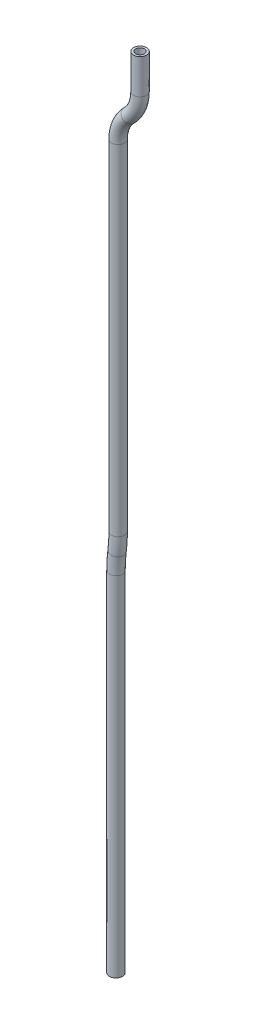
ISO-10303-21;
HEADER;
FILE_DESCRIPTION(('STEP AP214'),'2;1');
FILE_NAME('part.step','',(''),(''),'','','');
FILE_SCHEMA(('AUTOMOTIVE_DESIGN { 1 0 10303 214 1 1 1 1 }'));
ENDSEC;
DATA;
#1=APPLICATION_CONTEXT('core data for automotive mechanical design processes');
#2=APPLICATION_PROTOCOL_DEFINITION('international standard','automotive_design',2000,#1);
#3=PRODUCT_CONTEXT('',#1,'mechanical');
#4=PRODUCT('Part','Part','',(#3));
#5=PRODUCT_RELATED_PRODUCT_CATEGORY('part','',(#4));
#6=PRODUCT_DEFINITION_FORMATION('','',#4);
#7=PRODUCT_DEFINITION_CONTEXT('part definition',#1,'design');
#8=PRODUCT_DEFINITION('design','',#6,#7);
#9=PRODUCT_DEFINITION_SHAPE('','',#8);
#10=(LENGTH_UNIT() NAMED_UNIT(*) SI_UNIT(.MILLI.,.METRE.));
#11=(NAMED_UNIT(*) PLANE_ANGLE_UNIT() SI_UNIT($,.RADIAN.));
#12=(NAMED_UNIT(*) SI_UNIT($,.STERADIAN.) SOLID_ANGLE_UNIT());
#13=UNCERTAINTY_MEASURE_WITH_UNIT(LENGTH_MEASURE(1.E-05),#10,'distance_accuracy_value','');
#14=(GEOMETRIC_REPRESENTATION_CONTEXT(3) GLOBAL_UNCERTAINTY_ASSIGNED_CONTEXT((#13)) GLOBAL_UNIT_ASSIGNED_CONTEXT((#10,
#11,#12)) REPRESENTATION_CONTEXT('',''));
#15=CARTESIAN_POINT('',(0.,0.,0.));
#16=DIRECTION('',(0.,0.,1.));
#17=DIRECTION('',(1.,0.,0.));
#18=AXIS2_PLACEMENT_3D('',#15,#16,#17);
#19=CARTESIAN_POINT('',(17.552982674,590.55,0.));
#20=DIRECTION('',(0.,-1.,0.));
#21=DIRECTION('',(0.,0.,-1.));
#22=AXIS2_PLACEMENT_3D('',#19,#20,#21);
#23=CYLINDRICAL_SURFACE('',#22,4.7625);
#24=CARTESIAN_POINT('',(17.552982674,565.15,0.));
#25=DIRECTION('',(0.,1.,0.));
#26=DIRECTION('',(0.,0.,1.));
#27=AXIS2_PLACEMENT_3D('',#24,#25,#26);
#28=CIRCLE('',#27,4.7625);
#29=CARTESIAN_POINT('',(22.315482674,565.15,0.));
#30=VERTEX_POINT('',#29);
#31=EDGE_CURVE('E61',#30,#30,#28,.T.);
#32=ORIENTED_EDGE('',*,*,#31,.T.);
#33=EDGE_LOOP('',(#32));
#34=FACE_BOUND('',#33,.T.);
#35=CARTESIAN_POINT('',(17.552982674,590.55,0.));
#36=DIRECTION('',(0.,1.,0.));
#37=DIRECTION('',(0.,0.,1.));
#38=AXIS2_PLACEMENT_3D('',#35,#36,#37);
#39=CIRCLE('',#38,4.7625);
#40=CARTESIAN_POINT('',(17.552982674,590.55,4.7625));
#41=VERTEX_POINT('',#40);
#42=EDGE_CURVE('E58',#41,#41,#39,.T.);
#43=ORIENTED_EDGE('',*,*,#42,.F.);
#44=EDGE_LOOP('',(#43));
#45=FACE_BOUND('',#44,.T.);
#46=ADVANCED_FACE('F37',(#34,#45),#23,.T.);
#47=CARTESIAN_POINT('',(-9.16883137727299,565.15,0.));
#48=DIRECTION('',(0.,0.,-1.));
#49=DIRECTION('',(-1.,0.,0.));
#50=AXIS2_PLACEMENT_3D('',#47,#48,#49);
#51=TOROIDAL_SURFACE('',#50,26.721814051273,4.7625);
#52=CARTESIAN_POINT('',(9.57024133699998,546.1,0.));
#53=DIRECTION('',(0.712900702154707,0.70126499190201,0.));
#54=DIRECTION('',(0.,0.,1.));
#55=AXIS2_PLACEMENT_3D('',#52,#53,#54);
#56=CIRCLE('',#55,4.7625);
#57=CARTESIAN_POINT('',(12.9100158609333,542.704810405988,0.));
#58=VERTEX_POINT('',#57);
#59=EDGE_CURVE('E64',#58,#58,#56,.T.);
#60=CARTESIAN_POINT('',(-9.16883137727299,565.15,0.));
#61=DIRECTION('',(0.,0.,-1.));
#62=DIRECTION('',(-1.,0.,0.));
#63=AXIS2_PLACEMENT_3D('',#60,#61,#62);
#64=CIRCLE('',#63,31.484314051273);
#65=EDGE_CURVE('',#30,#58,#64,.T.);
#66=ORIENTED_EDGE('',*,*,#31,.F.);
#67=ORIENTED_EDGE('',*,*,#59,.T.);
#68=ORIENTED_EDGE('',*,*,#65,.T.);
#69=ORIENTED_EDGE('',*,*,#65,.F.);
#70=EDGE_LOOP('',(#66,#68,#67,#69));
#71=FACE_BOUND('',#70,.T.);
#72=ADVANCED_FACE('F112',(#71),#51,.T.);
#73=CARTESIAN_POINT('',(28.309314051273,527.05,0.));
#74=DIRECTION('',(0.,0.,1.));
#75=DIRECTION('',(1.,0.,0.));
#76=AXIS2_PLACEMENT_3D('',#73,#74,#75);
#77=TOROIDAL_SURFACE('',#76,26.7218140512729,4.7625);
#78=CARTESIAN_POINT('',(1.58750000000004,527.05,0.));
#79=DIRECTION('',(0.,1.,0.));
#80=DIRECTION('',(0.,0.,1.));
#81=AXIS2_PLACEMENT_3D('',#78,#79,#80);
#82=CIRCLE('',#81,4.7625);
#83=CARTESIAN_POINT('',(1.58750000000004,527.05,4.7625));
#84=VERTEX_POINT('',#83);
#85=EDGE_CURVE('E67',#84,#84,#82,.T.);
#86=ORIENTED_EDGE('',*,*,#85,.T.);
#87=EDGE_LOOP('',(#86));
#88=FACE_BOUND('',#87,.T.);
#89=ORIENTED_EDGE('',*,*,#59,.F.);
#90=EDGE_LOOP('',(#89));
#91=FACE_BOUND('',#90,.T.);
#92=ADVANCED_FACE('F116',(#88,#91),#77,.T.);
#93=CARTESIAN_POINT('',(1.5875,527.05,0.));
#94=DIRECTION('',(0.,-1.,0.));
#95=DIRECTION('',(1.,0.,0.));
#96=AXIS2_PLACEMENT_3D('',#93,#94,#95);
#97=CYLINDRICAL_SURFACE('',#96,4.7625);
#98=CARTESIAN_POINT('',(1.58750000000001,279.4,0.));
#99=DIRECTION('',(0.,1.,0.));
#100=DIRECTION('',(0.,0.,1.));
#101=AXIS2_PLACEMENT_3D('',#98,#99,#100);
#102=CIRCLE('',#101,4.7625);
#103=CARTESIAN_POINT('',(6.35000000000001,279.4,0.));
#104=VERTEX_POINT('',#103);
#105=EDGE_CURVE('E70',#104,#104,#102,.T.);
#106=ORIENTED_EDGE('',*,*,#105,.T.);
#107=EDGE_LOOP('',(#106));
#108=FACE_BOUND('',#107,.T.);
#109=ORIENTED_EDGE('',*,*,#85,.F.);
#110=EDGE_LOOP('',(#109));
#111=FACE_BOUND('',#110,.T.);
#112=ADVANCED_FACE('F120',(#108,#111),#97,.T.);
#113=CARTESIAN_POINT('',(-100.409375000001,279.4,0.));
#114=DIRECTION('',(0.,0.,-1.));
#115=DIRECTION('',(-1.,0.,0.));
#116=AXIS2_PLACEMENT_3D('',#113,#114,#115);
#117=TOROIDAL_SURFACE('',#116,101.996875000001,4.7625);
#118=CARTESIAN_POINT('',(0.79375000000001,266.7,0.));
#119=DIRECTION('',(0.124513618677041,0.992217898832685,0.));
#120=DIRECTION('',(0.,0.,1.));
#121=AXIS2_PLACEMENT_3D('',#118,#119,#120);
#122=CIRCLE('',#121,4.7625);
#123=CARTESIAN_POINT('',(5.51918774319068,266.107003891051,0.));
#124=VERTEX_POINT('',#123);
#125=EDGE_CURVE('E72',#124,#124,#122,.T.);
#126=CARTESIAN_POINT('',(-100.409375000001,279.4,0.));
#127=DIRECTION('',(0.,0.,-1.));
#128=DIRECTION('',(-1.,0.,0.));
#129=AXIS2_PLACEMENT_3D('',#126,#127,#128);
#130=CIRCLE('',#129,106.759375000001);
#131=EDGE_CURVE('',#104,#124,#130,.T.);
#132=ORIENTED_EDGE('',*,*,#105,.F.);
#133=ORIENTED_EDGE('',*,*,#125,.T.);
#134=ORIENTED_EDGE('',*,*,#131,.T.);
#135=ORIENTED_EDGE('',*,*,#131,.F.);
#136=EDGE_LOOP('',(#132,#134,#133,#135));
#137=FACE_BOUND('',#136,.T.);
#138=ADVANCED_FACE('F92',(#137),#117,.T.);
#139=CARTESIAN_POINT('',(101.996875000001,254.,0.));
#140=DIRECTION('',(0.,0.,1.));
#141=DIRECTION('',(1.,0.,0.));
#142=AXIS2_PLACEMENT_3D('',#139,#140,#141);
#143=TOROIDAL_SURFACE('',#142,101.996875000001,4.7625);
#144=CARTESIAN_POINT('',(0.,254.,0.));
#145=DIRECTION('',(0.,1.,0.));
#146=DIRECTION('',(0.,0.,1.));
#147=AXIS2_PLACEMENT_3D('',#144,#145,#146);
#148=CIRCLE('',#147,4.7625);
#149=CARTESIAN_POINT('',(0.,254.,4.7625));
#150=VERTEX_POINT('',#149);
#151=EDGE_CURVE('E41',#150,#150,#148,.T.);
#152=ORIENTED_EDGE('',*,*,#151,.T.);
#153=EDGE_LOOP('',(#152));
#154=FACE_BOUND('',#153,.T.);
#155=ORIENTED_EDGE('',*,*,#125,.F.);
#156=EDGE_LOOP('',(#155));
#157=FACE_BOUND('',#156,.T.);
#158=ADVANCED_FACE('F79',(#154,#157),#143,.T.);
#159=CARTESIAN_POINT('',(0.,254.,0.));
#160=DIRECTION('',(0.,-1.,0.));
#161=DIRECTION('',(0.,0.,-1.));
#162=AXIS2_PLACEMENT_3D('',#159,#160,#161);
#163=CYLINDRICAL_SURFACE('',#162,4.7625);
#164=CARTESIAN_POINT('',(0.,0.,0.));
#165=DIRECTION('',(0.,1.,0.));
#166=DIRECTION('',(0.,0.,1.));
#167=AXIS2_PLACEMENT_3D('',#164,#165,#166);
#168=CIRCLE('',#167,4.7625);
#169=CARTESIAN_POINT('',(0.,0.,4.7625));
#170=VERTEX_POINT('',#169);
#171=EDGE_CURVE('E54',#170,#170,#168,.T.);
#172=ORIENTED_EDGE('',*,*,#171,.T.);
#173=EDGE_LOOP('',(#172));
#174=FACE_BOUND('',#173,.T.);
#175=ORIENTED_EDGE('',*,*,#151,.F.);
#176=EDGE_LOOP('',(#175));
#177=FACE_BOUND('',#176,.T.);
#178=ADVANCED_FACE('F39',(#174,#177),#163,.T.);
#179=CARTESIAN_POINT('',(17.552982674,590.55,0.));
#180=DIRECTION('',(0.,1.,0.));
#181=DIRECTION('',(0.,0.,1.));
#182=AXIS2_PLACEMENT_3D('',#179,#180,#181);
#183=PLANE('',#182);
#184=CARTESIAN_POINT('',(17.552982674,590.55,0.));
#185=DIRECTION('',(0.,1.,0.));
#186=DIRECTION('',(0.,0.,1.));
#187=AXIS2_PLACEMENT_3D('',#184,#185,#186);
#188=CIRCLE('',#187,3.175);
#189=CARTESIAN_POINT('',(17.552982674,590.55,3.175));
#190=VERTEX_POINT('',#189);
#191=EDGE_CURVE('E57',#190,#190,#188,.F.);
#192=ORIENTED_EDGE('',*,*,#191,.T.);
#193=EDGE_LOOP('',(#192));
#194=FACE_BOUND('',#193,.T.);
#195=ORIENTED_EDGE('',*,*,#42,.T.);
#196=EDGE_LOOP('',(#195));
#197=FACE_BOUND('',#196,.T.);
#198=ADVANCED_FACE('F83',(#194,#197),#183,.T.);
#199=CARTESIAN_POINT('',(0.,0.,0.));
#200=DIRECTION('',(0.,1.,0.));
#201=DIRECTION('',(0.,0.,1.));
#202=AXIS2_PLACEMENT_3D('',#199,#200,#201);
#203=PLANE('',#202);
#204=CARTESIAN_POINT('',(0.,0.,0.));
#205=DIRECTION('',(0.,1.,0.));
#206=DIRECTION('',(0.,0.,1.));
#207=AXIS2_PLACEMENT_3D('',#204,#205,#206);
#208=CIRCLE('',#207,3.175);
#209=CARTESIAN_POINT('',(0.,0.,3.175));
#210=VERTEX_POINT('',#209);
#211=EDGE_CURVE('E10',#210,#210,#208,.F.);
#212=ORIENTED_EDGE('',*,*,#211,.F.);
#213=EDGE_LOOP('',(#212));
#214=FACE_BOUND('',#213,.T.);
#215=ORIENTED_EDGE('',*,*,#171,.F.);
#216=EDGE_LOOP('',(#215));
#217=FACE_BOUND('',#216,.T.);
#218=ADVANCED_FACE('F89',(#214,#217),#203,.F.);
#219=CARTESIAN_POINT('',(17.552982674,590.55,0.));
#220=DIRECTION('',(0.,-1.,0.));
#221=DIRECTION('',(0.,0.,-1.));
#222=AXIS2_PLACEMENT_3D('',#219,#220,#221);
#223=CYLINDRICAL_SURFACE('',#222,3.175);
#224=CARTESIAN_POINT('',(17.552982674,565.15,0.));
#225=DIRECTION('',(0.,1.,0.));
#226=DIRECTION('',(0.,0.,1.));
#227=AXIS2_PLACEMENT_3D('',#224,#225,#226);
#228=CIRCLE('',#227,3.175);
#229=CARTESIAN_POINT('',(20.727982674,565.15,0.));
#230=VERTEX_POINT('',#229);
#231=EDGE_CURVE('E214',#230,#230,#228,.F.);
#232=ORIENTED_EDGE('',*,*,#231,.T.);
#233=EDGE_LOOP('',(#232));
#234=FACE_BOUND('',#233,.T.);
#235=ORIENTED_EDGE('',*,*,#191,.F.);
#236=EDGE_LOOP('',(#235));
#237=FACE_BOUND('',#236,.T.);
#238=ADVANCED_FACE('F107',(#234,#237),#223,.F.);
#239=CARTESIAN_POINT('',(-9.16883137727299,565.15,0.));
#240=DIRECTION('',(0.,0.,-1.));
#241=DIRECTION('',(-1.,0.,0.));
#242=AXIS2_PLACEMENT_3D('',#239,#240,#241);
#243=TOROIDAL_SURFACE('',#242,26.721814051273,3.175);
#244=CARTESIAN_POINT('',(9.57024133699998,546.1,0.));
#245=DIRECTION('',(0.712900702154707,0.70126499190201,0.));
#246=DIRECTION('',(0.,0.,1.));
#247=AXIS2_PLACEMENT_3D('',#244,#245,#246);
#248=CIRCLE('',#247,3.175);
#249=CARTESIAN_POINT('',(11.7967576862889,543.836540270659,0.));
#250=VERTEX_POINT('',#249);
#251=EDGE_CURVE('E209',#250,#250,#248,.F.);
#252=CARTESIAN_POINT('',(-9.16883137727299,565.15,0.));
#253=DIRECTION('',(0.,0.,-1.));
#254=DIRECTION('',(-1.,0.,0.));
#255=AXIS2_PLACEMENT_3D('',#252,#253,#254);
#256=CIRCLE('',#255,29.896814051273);
#257=EDGE_CURVE('',#230,#250,#256,.T.);
#258=ORIENTED_EDGE('',*,*,#231,.F.);
#259=ORIENTED_EDGE('',*,*,#251,.T.);
#260=ORIENTED_EDGE('',*,*,#257,.T.);
#261=ORIENTED_EDGE('',*,*,#257,.F.);
#262=EDGE_LOOP('',(#258,#260,#259,#261));
#263=FACE_BOUND('',#262,.T.);
#264=ADVANCED_FACE('F162',(#263),#243,.F.);
#265=CARTESIAN_POINT('',(28.309314051273,527.05,0.));
#266=DIRECTION('',(0.,0.,1.));
#267=DIRECTION('',(1.,0.,0.));
#268=AXIS2_PLACEMENT_3D('',#265,#266,#267);
#269=TOROIDAL_SURFACE('',#268,26.7218140512729,3.175);
#270=CARTESIAN_POINT('',(1.58750000000004,527.05,0.));
#271=DIRECTION('',(0.,1.,0.));
#272=DIRECTION('',(0.,0.,1.));
#273=AXIS2_PLACEMENT_3D('',#270,#271,#272);
#274=CIRCLE('',#273,3.175);
#275=CARTESIAN_POINT('',(1.58750000000004,527.05,3.175));
#276=VERTEX_POINT('',#275);
#277=EDGE_CURVE('E206',#276,#276,#274,.F.);
#278=ORIENTED_EDGE('',*,*,#277,.T.);
#279=EDGE_LOOP('',(#278));
#280=FACE_BOUND('',#279,.T.);
#281=ORIENTED_EDGE('',*,*,#251,.F.);
#282=EDGE_LOOP('',(#281));
#283=FACE_BOUND('',#282,.T.);
#284=ADVANCED_FACE('F170',(#280,#283),#269,.F.);
#285=CARTESIAN_POINT('',(1.5875,527.05,0.));
#286=DIRECTION('',(0.,-1.,0.));
#287=DIRECTION('',(1.,0.,0.));
#288=AXIS2_PLACEMENT_3D('',#285,#286,#287);
#289=CYLINDRICAL_SURFACE('',#288,3.175);
#290=CARTESIAN_POINT('',(1.58750000000001,279.4,0.));
#291=DIRECTION('',(0.,1.,0.));
#292=DIRECTION('',(0.,0.,1.));
#293=AXIS2_PLACEMENT_3D('',#290,#291,#292);
#294=CIRCLE('',#293,3.175);
#295=CARTESIAN_POINT('',(4.7625,279.4,0.));
#296=VERTEX_POINT('',#295);
#297=EDGE_CURVE('E205',#296,#296,#294,.F.);
#298=ORIENTED_EDGE('',*,*,#297,.T.);
#299=EDGE_LOOP('',(#298));
#300=FACE_BOUND('',#299,.T.);
#301=ORIENTED_EDGE('',*,*,#277,.F.);
#302=EDGE_LOOP('',(#301));
#303=FACE_BOUND('',#302,.T.);
#304=ADVANCED_FACE('F178',(#300,#303),#289,.F.);
#305=CARTESIAN_POINT('',(-100.409375000001,279.4,0.));
#306=DIRECTION('',(0.,0.,-1.));
#307=DIRECTION('',(-1.,0.,0.));
#308=AXIS2_PLACEMENT_3D('',#305,#306,#307);
#309=TOROIDAL_SURFACE('',#308,101.996875000001,3.175);
#310=CARTESIAN_POINT('',(0.79375000000001,266.7,0.));
#311=DIRECTION('',(0.124513618677041,0.992217898832685,0.));
#312=DIRECTION('',(0.,0.,1.));
#313=AXIS2_PLACEMENT_3D('',#310,#311,#312);
#314=CIRCLE('',#313,3.175);
#315=CARTESIAN_POINT('',(3.94404182879379,266.3046692607,0.));
#316=VERTEX_POINT('',#315);
#317=EDGE_CURVE('E50',#316,#316,#314,.F.);
#318=CARTESIAN_POINT('',(-100.409375000001,279.4,0.));
#319=DIRECTION('',(0.,0.,-1.));
#320=DIRECTION('',(-1.,0.,0.));
#321=AXIS2_PLACEMENT_3D('',#318,#319,#320);
#322=CIRCLE('',#321,105.171875000001);
#323=EDGE_CURVE('',#296,#316,#322,.T.);
#324=ORIENTED_EDGE('',*,*,#297,.F.);
#325=ORIENTED_EDGE('',*,*,#317,.T.);
#326=ORIENTED_EDGE('',*,*,#323,.T.);
#327=ORIENTED_EDGE('',*,*,#323,.F.);
#328=EDGE_LOOP('',(#324,#326,#325,#327));
#329=FACE_BOUND('',#328,.T.);
#330=ADVANCED_FACE('F100',(#329),#309,.F.);
#331=CARTESIAN_POINT('',(101.996875000001,254.,0.));
#332=DIRECTION('',(0.,0.,1.));
#333=DIRECTION('',(1.,0.,0.));
#334=AXIS2_PLACEMENT_3D('',#331,#332,#333);
#335=TOROIDAL_SURFACE('',#334,101.996875000001,3.175);
#336=CARTESIAN_POINT('',(0.,254.,0.));
#337=DIRECTION('',(0.,1.,0.));
#338=DIRECTION('',(0.,0.,1.));
#339=AXIS2_PLACEMENT_3D('',#336,#337,#338);
#340=CIRCLE('',#339,3.175);
#341=CARTESIAN_POINT('',(0.,254.,3.175));
#342=VERTEX_POINT('',#341);
#343=EDGE_CURVE('E45',#342,#342,#340,.F.);
#344=ORIENTED_EDGE('',*,*,#343,.T.);
#345=EDGE_LOOP('',(#344));
#346=FACE_BOUND('',#345,.T.);
#347=ORIENTED_EDGE('',*,*,#317,.F.);
#348=EDGE_LOOP('',(#347));
#349=FACE_BOUND('',#348,.T.);
#350=ADVANCED_FACE('F95',(#346,#349),#335,.F.);
#351=CARTESIAN_POINT('',(0.,254.,0.));
#352=DIRECTION('',(0.,-1.,0.));
#353=DIRECTION('',(0.,0.,-1.));
#354=AXIS2_PLACEMENT_3D('',#351,#352,#353);
#355=CYLINDRICAL_SURFACE('',#354,3.175);
#356=ORIENTED_EDGE('',*,*,#211,.T.);
#357=EDGE_LOOP('',(#356));
#358=FACE_BOUND('',#357,.T.);
#359=ORIENTED_EDGE('',*,*,#343,.F.);
#360=EDGE_LOOP('',(#359));
#361=FACE_BOUND('',#360,.T.);
#362=ADVANCED_FACE('F93',(#358,#361),#355,.F.);
#363=CLOSED_SHELL('',(#46,#72,#92,#112,#138,#158,#178,#198,#218,#238,#264,#284,#304,#330,#350,#362));
#364=MANIFOLD_SOLID_BREP('B2',#363);
#365=ADVANCED_BREP_SHAPE_REPRESENTATION('',(#18,#364),#14);
#366=SHAPE_DEFINITION_REPRESENTATION(#9,#365);
ENDSEC;
END-ISO-10303-21;
